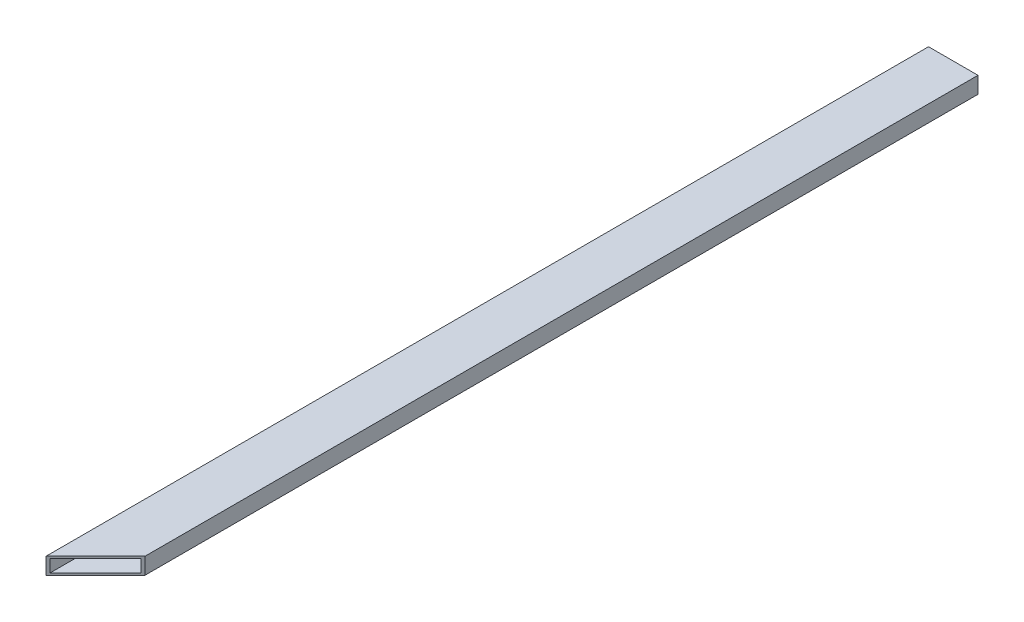
ISO-10303-21;
HEADER;
FILE_DESCRIPTION(('STEP AP214'),'2;1');
FILE_NAME('part.step','',(''),(''),'','','');
FILE_SCHEMA(('AUTOMOTIVE_DESIGN { 1 0 10303 214 1 1 1 1 }'));
ENDSEC;
DATA;
#1=APPLICATION_CONTEXT('core data for automotive mechanical design processes');
#2=APPLICATION_PROTOCOL_DEFINITION('international standard','automotive_design',2000,#1);
#3=PRODUCT_CONTEXT('',#1,'mechanical');
#4=PRODUCT('Part','Part','',(#3));
#5=PRODUCT_RELATED_PRODUCT_CATEGORY('part','',(#4));
#6=PRODUCT_DEFINITION_FORMATION('','',#4);
#7=PRODUCT_DEFINITION_CONTEXT('part definition',#1,'design');
#8=PRODUCT_DEFINITION('design','',#6,#7);
#9=PRODUCT_DEFINITION_SHAPE('','',#8);
#10=(LENGTH_UNIT() NAMED_UNIT(*) SI_UNIT(.MILLI.,.METRE.));
#11=(NAMED_UNIT(*) PLANE_ANGLE_UNIT() SI_UNIT($,.RADIAN.));
#12=(NAMED_UNIT(*) SI_UNIT($,.STERADIAN.) SOLID_ANGLE_UNIT());
#13=UNCERTAINTY_MEASURE_WITH_UNIT(LENGTH_MEASURE(1.E-05),#10,'distance_accuracy_value','');
#14=(GEOMETRIC_REPRESENTATION_CONTEXT(3) GLOBAL_UNCERTAINTY_ASSIGNED_CONTEXT((#13)) GLOBAL_UNIT_ASSIGNED_CONTEXT((#10,
#11,#12)) REPRESENTATION_CONTEXT('',''));
#15=CARTESIAN_POINT('',(0.,0.,0.));
#16=DIRECTION('',(0.,0.,1.));
#17=DIRECTION('',(1.,0.,0.));
#18=AXIS2_PLACEMENT_3D('',#15,#16,#17);
#19=CARTESIAN_POINT('',(38.1,12.7,-679.45));
#20=DIRECTION('',(0.,1.,0.));
#21=DIRECTION('',(0.,0.,1.));
#22=AXIS2_PLACEMENT_3D('',#19,#20,#21);
#23=PLANE('',#22);
#24=DIRECTION('',(0.,0.,1.));
#25=VECTOR('',#24,1.);
#26=CARTESIAN_POINT('',(-38.1,12.7,-679.45));
#27=LINE('',#26,#25);
#28=CARTESIAN_POINT('',(-38.1,12.7,679.45));
#29=VERTEX_POINT('',#28);
#30=CARTESIAN_POINT('',(-38.1,12.7,-679.45));
#31=VERTEX_POINT('',#30);
#32=EDGE_CURVE('E89',#29,#31,#27,.F.);
#33=ORIENTED_EDGE('',*,*,#32,.F.);
#34=DIRECTION('',(0.707106781186548,0.,-0.707106781186548));
#35=VECTOR('',#34,1.);
#36=CARTESIAN_POINT('',(0.,12.7,641.35));
#37=LINE('',#36,#35);
#38=CARTESIAN_POINT('',(38.1,12.7,603.25));
#39=VERTEX_POINT('',#38);
#40=EDGE_CURVE('E131',#39,#29,#37,.F.);
#41=ORIENTED_EDGE('',*,*,#40,.F.);
#42=DIRECTION('',(0.,0.,-1.));
#43=VECTOR('',#42,1.);
#44=CARTESIAN_POINT('',(38.1,12.7,-679.45));
#45=LINE('',#44,#43);
#46=CARTESIAN_POINT('',(38.1,12.7,-679.45));
#47=VERTEX_POINT('',#46);
#48=EDGE_CURVE('E141',#47,#39,#45,.F.);
#49=ORIENTED_EDGE('',*,*,#48,.F.);
#50=DIRECTION('',(1.,0.,0.));
#51=VECTOR('',#50,1.);
#52=CARTESIAN_POINT('',(0.,12.7,-679.45));
#53=LINE('',#52,#51);
#54=EDGE_CURVE('E98',#47,#31,#53,.F.);
#55=ORIENTED_EDGE('',*,*,#54,.T.);
#56=EDGE_LOOP('',(#33,#41,#49,#55));
#57=FACE_BOUND('',#56,.T.);
#58=ADVANCED_FACE('F17',(#57),#23,.T.);
#59=CARTESIAN_POINT('',(35.052,9.652,-679.45));
#60=DIRECTION('',(-1.,0.,0.));
#61=DIRECTION('',(0.,0.,1.));
#62=AXIS2_PLACEMENT_3D('',#59,#60,#61);
#63=PLANE('',#62);
#64=DIRECTION('',(0.,0.,1.));
#65=VECTOR('',#64,1.);
#66=CARTESIAN_POINT('',(35.052,-9.652,-679.45));
#67=LINE('',#66,#65);
#68=CARTESIAN_POINT('',(35.052,-9.652,606.298));
#69=VERTEX_POINT('',#68);
#70=CARTESIAN_POINT('',(35.052,-9.652,-679.45));
#71=VERTEX_POINT('',#70);
#72=EDGE_CURVE('E20',#69,#71,#67,.F.);
#73=ORIENTED_EDGE('',*,*,#72,.F.);
#74=DIRECTION('',(0.,1.,0.));
#75=VECTOR('',#74,1.);
#76=CARTESIAN_POINT('',(35.052,2.7071678232456E-13,606.298));
#77=LINE('',#76,#75);
#78=CARTESIAN_POINT('',(35.052,9.652,606.298));
#79=VERTEX_POINT('',#78);
#80=EDGE_CURVE('E85',#79,#69,#77,.F.);
#81=ORIENTED_EDGE('',*,*,#80,.F.);
#82=DIRECTION('',(0.,0.,-1.));
#83=VECTOR('',#82,1.);
#84=CARTESIAN_POINT('',(35.052,9.652,-679.45));
#85=LINE('',#84,#83);
#86=CARTESIAN_POINT('',(35.052,9.652,-679.45));
#87=VERTEX_POINT('',#86);
#88=EDGE_CURVE('E78',#87,#79,#85,.F.);
#89=ORIENTED_EDGE('',*,*,#88,.F.);
#90=DIRECTION('',(0.,1.,0.));
#91=VECTOR('',#90,1.);
#92=CARTESIAN_POINT('',(35.052,0.,-679.45));
#93=LINE('',#92,#91);
#94=EDGE_CURVE('E82',#87,#71,#93,.F.);
#95=ORIENTED_EDGE('',*,*,#94,.T.);
#96=EDGE_LOOP('',(#73,#81,#89,#95));
#97=FACE_BOUND('',#96,.T.);
#98=ADVANCED_FACE('F80',(#97),#63,.T.);
#99=CARTESIAN_POINT('',(35.052,-9.652,-679.45));
#100=DIRECTION('',(0.,1.,0.));
#101=DIRECTION('',(0.,0.,1.));
#102=AXIS2_PLACEMENT_3D('',#99,#100,#101);
#103=PLANE('',#102);
#104=DIRECTION('',(0.,0.,-1.));
#105=VECTOR('',#104,1.);
#106=CARTESIAN_POINT('',(-35.052,-9.652,-679.45));
#107=LINE('',#106,#105);
#108=CARTESIAN_POINT('',(-35.052,-9.652,676.402));
#109=VERTEX_POINT('',#108);
#110=CARTESIAN_POINT('',(-35.052,-9.652,-679.45));
#111=VERTEX_POINT('',#110);
#112=EDGE_CURVE('E115',#109,#111,#107,.T.);
#113=ORIENTED_EDGE('',*,*,#112,.F.);
#114=DIRECTION('',(0.707106781186548,0.,-0.707106781186548));
#115=VECTOR('',#114,1.);
#116=CARTESIAN_POINT('',(0.,-9.652,641.35));
#117=LINE('',#116,#115);
#118=EDGE_CURVE('E123',#69,#109,#117,.F.);
#119=ORIENTED_EDGE('',*,*,#118,.F.);
#120=ORIENTED_EDGE('',*,*,#72,.T.);
#121=DIRECTION('',(1.,0.,0.));
#122=VECTOR('',#121,1.);
#123=CARTESIAN_POINT('',(0.,-9.652,-679.45));
#124=LINE('',#123,#122);
#125=EDGE_CURVE('E103',#71,#111,#124,.F.);
#126=ORIENTED_EDGE('',*,*,#125,.T.);
#127=EDGE_LOOP('',(#113,#119,#120,#126));
#128=FACE_BOUND('',#127,.T.);
#129=ADVANCED_FACE('F121',(#128),#103,.T.);
#130=CARTESIAN_POINT('',(-35.052,-9.652,-679.45));
#131=DIRECTION('',(1.,0.,0.));
#132=DIRECTION('',(0.,0.,-1.));
#133=AXIS2_PLACEMENT_3D('',#130,#131,#132);
#134=PLANE('',#133);
#135=DIRECTION('',(0.,0.,-1.));
#136=VECTOR('',#135,1.);
#137=CARTESIAN_POINT('',(-35.052,9.652,-679.45));
#138=LINE('',#137,#136);
#139=CARTESIAN_POINT('',(-35.052,9.652,676.402));
#140=VERTEX_POINT('',#139);
#141=CARTESIAN_POINT('',(-35.052,9.652,-679.45));
#142=VERTEX_POINT('',#141);
#143=EDGE_CURVE('E90',#140,#142,#138,.T.);
#144=ORIENTED_EDGE('',*,*,#143,.F.);
#145=DIRECTION('',(0.,1.,0.));
#146=VECTOR('',#145,1.);
#147=CARTESIAN_POINT('',(-35.052,2.7071678232456E-13,676.402));
#148=LINE('',#147,#146);
#149=EDGE_CURVE('E126',#109,#140,#148,.T.);
#150=ORIENTED_EDGE('',*,*,#149,.F.);
#151=ORIENTED_EDGE('',*,*,#112,.T.);
#152=DIRECTION('',(0.,1.,0.));
#153=VECTOR('',#152,1.);
#154=CARTESIAN_POINT('',(-35.052,0.,-679.45));
#155=LINE('',#154,#153);
#156=EDGE_CURVE('E105',#111,#142,#155,.T.);
#157=ORIENTED_EDGE('',*,*,#156,.T.);
#158=EDGE_LOOP('',(#144,#150,#151,#157));
#159=FACE_BOUND('',#158,.T.);
#160=ADVANCED_FACE('F145',(#159),#134,.T.);
#161=CARTESIAN_POINT('',(-35.052,9.652,-679.45));
#162=DIRECTION('',(0.,-1.,0.));
#163=DIRECTION('',(0.,0.,-1.));
#164=AXIS2_PLACEMENT_3D('',#161,#162,#163);
#165=PLANE('',#164);
#166=ORIENTED_EDGE('',*,*,#88,.T.);
#167=DIRECTION('',(0.707106781186548,0.,-0.707106781186548));
#168=VECTOR('',#167,1.);
#169=CARTESIAN_POINT('',(0.,9.652,641.35));
#170=LINE('',#169,#168);
#171=EDGE_CURVE('E130',#140,#79,#170,.T.);
#172=ORIENTED_EDGE('',*,*,#171,.F.);
#173=ORIENTED_EDGE('',*,*,#143,.T.);
#174=DIRECTION('',(1.,0.,0.));
#175=VECTOR('',#174,1.);
#176=CARTESIAN_POINT('',(0.,9.652,-679.45));
#177=LINE('',#176,#175);
#178=EDGE_CURVE('E93',#142,#87,#177,.T.);
#179=ORIENTED_EDGE('',*,*,#178,.T.);
#180=EDGE_LOOP('',(#166,#172,#173,#179));
#181=FACE_BOUND('',#180,.T.);
#182=ADVANCED_FACE('F94',(#181),#165,.T.);
#183=CARTESIAN_POINT('',(-38.1,12.7,-679.45));
#184=DIRECTION('',(-1.,0.,0.));
#185=DIRECTION('',(0.,0.,1.));
#186=AXIS2_PLACEMENT_3D('',#183,#184,#185);
#187=PLANE('',#186);
#188=DIRECTION('',(0.,0.,-1.));
#189=VECTOR('',#188,1.);
#190=CARTESIAN_POINT('',(-38.1,-12.7,-679.45));
#191=LINE('',#190,#189);
#192=CARTESIAN_POINT('',(-38.1,-12.7,679.45));
#193=VERTEX_POINT('',#192);
#194=CARTESIAN_POINT('',(-38.1,-12.7,-679.45));
#195=VERTEX_POINT('',#194);
#196=EDGE_CURVE('E146',#193,#195,#191,.T.);
#197=ORIENTED_EDGE('',*,*,#196,.F.);
#198=DIRECTION('',(0.,1.,0.));
#199=VECTOR('',#198,1.);
#200=CARTESIAN_POINT('',(-38.1,2.7071678232456E-13,679.45));
#201=LINE('',#200,#199);
#202=EDGE_CURVE('E138',#29,#193,#201,.F.);
#203=ORIENTED_EDGE('',*,*,#202,.F.);
#204=ORIENTED_EDGE('',*,*,#32,.T.);
#205=DIRECTION('',(0.,1.,0.));
#206=VECTOR('',#205,1.);
#207=CARTESIAN_POINT('',(-38.1,0.,-679.45));
#208=LINE('',#207,#206);
#209=EDGE_CURVE('E111',#31,#195,#208,.F.);
#210=ORIENTED_EDGE('',*,*,#209,.T.);
#211=EDGE_LOOP('',(#197,#203,#204,#210));
#212=FACE_BOUND('',#211,.T.);
#213=ADVANCED_FACE('F165',(#212),#187,.T.);
#214=CARTESIAN_POINT('',(0.,0.,-679.45));
#215=DIRECTION('',(0.,0.,1.));
#216=DIRECTION('',(1.,0.,0.));
#217=AXIS2_PLACEMENT_3D('',#214,#215,#216);
#218=PLANE('',#217);
#219=ORIENTED_EDGE('',*,*,#125,.F.);
#220=ORIENTED_EDGE('',*,*,#94,.F.);
#221=ORIENTED_EDGE('',*,*,#178,.F.);
#222=ORIENTED_EDGE('',*,*,#156,.F.);
#223=EDGE_LOOP('',(#219,#220,#221,#222));
#224=FACE_BOUND('',#223,.T.);
#225=DIRECTION('',(0.,1.,0.));
#226=VECTOR('',#225,1.);
#227=CARTESIAN_POINT('',(38.1,-12.7,-679.45));
#228=LINE('',#227,#226);
#229=CARTESIAN_POINT('',(38.1,-12.7,-679.45));
#230=VERTEX_POINT('',#229);
#231=EDGE_CURVE('E143',#230,#47,#228,.T.);
#232=ORIENTED_EDGE('',*,*,#231,.F.);
#233=DIRECTION('',(1.,0.,0.));
#234=VECTOR('',#233,1.);
#235=CARTESIAN_POINT('',(-38.1,-12.7,-679.45));
#236=LINE('',#235,#234);
#237=EDGE_CURVE('E151',#195,#230,#236,.T.);
#238=ORIENTED_EDGE('',*,*,#237,.F.);
#239=ORIENTED_EDGE('',*,*,#209,.F.);
#240=ORIENTED_EDGE('',*,*,#54,.F.);
#241=EDGE_LOOP('',(#232,#238,#239,#240));
#242=FACE_BOUND('',#241,.T.);
#243=ADVANCED_FACE('F101',(#224,#242),#218,.F.);
#244=CARTESIAN_POINT('',(38.1,-12.7,-679.45));
#245=DIRECTION('',(1.,0.,0.));
#246=DIRECTION('',(0.,0.,-1.));
#247=AXIS2_PLACEMENT_3D('',#244,#245,#246);
#248=PLANE('',#247);
#249=ORIENTED_EDGE('',*,*,#48,.T.);
#250=DIRECTION('',(0.,1.,0.));
#251=VECTOR('',#250,1.);
#252=CARTESIAN_POINT('',(38.1,2.7071678232456E-13,603.25));
#253=LINE('',#252,#251);
#254=CARTESIAN_POINT('',(38.1,-12.7,603.25));
#255=VERTEX_POINT('',#254);
#256=EDGE_CURVE('E35',#255,#39,#253,.T.);
#257=ORIENTED_EDGE('',*,*,#256,.F.);
#258=DIRECTION('',(0.,0.,-1.));
#259=VECTOR('',#258,1.);
#260=CARTESIAN_POINT('',(38.1,-12.7,-679.45));
#261=LINE('',#260,#259);
#262=EDGE_CURVE('E26',#230,#255,#261,.F.);
#263=ORIENTED_EDGE('',*,*,#262,.F.);
#264=ORIENTED_EDGE('',*,*,#231,.T.);
#265=EDGE_LOOP('',(#249,#257,#263,#264));
#266=FACE_BOUND('',#265,.T.);
#267=ADVANCED_FACE('F158',(#266),#248,.T.);
#268=CARTESIAN_POINT('',(0.,2.7071678232456E-13,641.35));
#269=DIRECTION('',(0.707106781186548,0.,0.707106781186548));
#270=DIRECTION('',(0.707106781186548,0.,-0.707106781186548));
#271=AXIS2_PLACEMENT_3D('',#268,#269,#270);
#272=PLANE('',#271);
#273=ORIENTED_EDGE('',*,*,#149,.T.);
#274=ORIENTED_EDGE('',*,*,#171,.T.);
#275=ORIENTED_EDGE('',*,*,#80,.T.);
#276=ORIENTED_EDGE('',*,*,#118,.T.);
#277=EDGE_LOOP('',(#273,#274,#275,#276));
#278=FACE_BOUND('',#277,.T.);
#279=ORIENTED_EDGE('',*,*,#256,.T.);
#280=ORIENTED_EDGE('',*,*,#40,.T.);
#281=ORIENTED_EDGE('',*,*,#202,.T.);
#282=DIRECTION('',(-0.707106781186547,0.,0.707106781186548));
#283=VECTOR('',#282,1.);
#284=CARTESIAN_POINT('',(38.1,-12.7,603.25));
#285=LINE('',#284,#283);
#286=EDGE_CURVE('E11',#255,#193,#285,.T.);
#287=ORIENTED_EDGE('',*,*,#286,.F.);
#288=EDGE_LOOP('',(#279,#280,#281,#287));
#289=FACE_BOUND('',#288,.T.);
#290=ADVANCED_FACE('F128',(#278,#289),#272,.T.);
#291=CARTESIAN_POINT('',(-38.1,-12.7,-679.45));
#292=DIRECTION('',(0.,-1.,0.));
#293=DIRECTION('',(0.,0.,-1.));
#294=AXIS2_PLACEMENT_3D('',#291,#292,#293);
#295=PLANE('',#294);
#296=ORIENTED_EDGE('',*,*,#262,.T.);
#297=ORIENTED_EDGE('',*,*,#286,.T.);
#298=ORIENTED_EDGE('',*,*,#196,.T.);
#299=ORIENTED_EDGE('',*,*,#237,.T.);
#300=EDGE_LOOP('',(#296,#297,#298,#299));
#301=FACE_BOUND('',#300,.T.);
#302=ADVANCED_FACE('F156',(#301),#295,.T.);
#303=CLOSED_SHELL('',(#58,#98,#129,#160,#182,#213,#243,#267,#290,#302));
#304=MANIFOLD_SOLID_BREP('B1',#303);
#305=ADVANCED_BREP_SHAPE_REPRESENTATION('',(#18,#304),#14);
#306=SHAPE_DEFINITION_REPRESENTATION(#9,#305);
ENDSEC;
END-ISO-10303-21;
